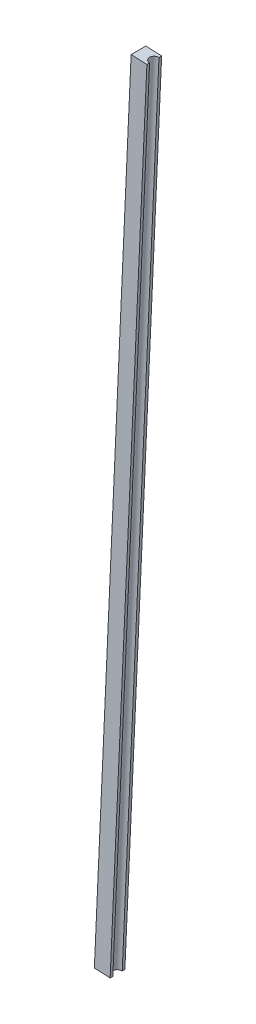
ISO-10303-21;
HEADER;
FILE_DESCRIPTION(('STEP AP214'),'2;1');
FILE_NAME('part.step','',(''),(''),'','','');
FILE_SCHEMA(('AUTOMOTIVE_DESIGN { 1 0 10303 214 1 1 1 1 }'));
ENDSEC;
DATA;
#1=APPLICATION_CONTEXT('core data for automotive mechanical design processes');
#2=APPLICATION_PROTOCOL_DEFINITION('international standard','automotive_design',2000,#1);
#3=PRODUCT_CONTEXT('',#1,'mechanical');
#4=PRODUCT('Part','Part','',(#3));
#5=PRODUCT_RELATED_PRODUCT_CATEGORY('part','',(#4));
#6=PRODUCT_DEFINITION_FORMATION('','',#4);
#7=PRODUCT_DEFINITION_CONTEXT('part definition',#1,'design');
#8=PRODUCT_DEFINITION('design','',#6,#7);
#9=PRODUCT_DEFINITION_SHAPE('','',#8);
#10=(LENGTH_UNIT() NAMED_UNIT(*) SI_UNIT(.MILLI.,.METRE.));
#11=(NAMED_UNIT(*) PLANE_ANGLE_UNIT() SI_UNIT($,.RADIAN.));
#12=(NAMED_UNIT(*) SI_UNIT($,.STERADIAN.) SOLID_ANGLE_UNIT());
#13=UNCERTAINTY_MEASURE_WITH_UNIT(LENGTH_MEASURE(1.E-05),#10,'distance_accuracy_value','');
#14=(GEOMETRIC_REPRESENTATION_CONTEXT(3) GLOBAL_UNCERTAINTY_ASSIGNED_CONTEXT((#13)) GLOBAL_UNIT_ASSIGNED_CONTEXT((#10,
#11,#12)) REPRESENTATION_CONTEXT('',''));
#15=CARTESIAN_POINT('',(0.,0.,0.));
#16=DIRECTION('',(0.,0.,1.));
#17=DIRECTION('',(1.,0.,0.));
#18=AXIS2_PLACEMENT_3D('',#15,#16,#17);
#19=CARTESIAN_POINT('',(34.0668819369406,-273.797180723568,5.74050841179486));
#20=DIRECTION('',(0.998970569790716,-0.0453629881292205,0.));
#21=DIRECTION('',(0.,0.,-1.));
#22=AXIS2_PLACEMENT_3D('',#19,#20,#21);
#23=PLANE('',#22);
#24=DIRECTION('',(0.,0.,-1.));
#25=VECTOR('',#24,1.);
#26=CARTESIAN_POINT('',(45.8195249014578,-14.9838855021282,3.12419999999949));
#27=LINE('',#26,#25);
#28=CARTESIAN_POINT('',(45.8195249014598,-14.9838855021284,4.59740000000182));
#29=VERTEX_POINT('',#28);
#30=CARTESIAN_POINT('',(45.8195249014578,-14.9838855021282,5.4356));
#31=VERTEX_POINT('',#30);
#32=EDGE_CURVE('E68',#29,#31,#27,.F.);
#33=ORIENTED_EDGE('',*,*,#32,.T.);
#34=DIRECTION('',(0.045362988129241,0.998970569790715,0.));
#35=VECTOR('',#34,1.);
#36=CARTESIAN_POINT('',(40.0584254090455,-141.853147865521,5.4356));
#37=LINE('',#36,#35);
#38=CARTESIAN_POINT('',(34.2973259166352,-268.72241022897,5.4356));
#39=VERTEX_POINT('',#38);
#40=EDGE_CURVE('E93',#31,#39,#37,.F.);
#41=ORIENTED_EDGE('',*,*,#40,.T.);
#42=DIRECTION('',(0.,0.,-1.));
#43=VECTOR('',#42,1.);
#44=CARTESIAN_POINT('',(34.2973259166391,-268.722410228985,5.0165));
#45=LINE('',#44,#43);
#46=CARTESIAN_POINT('',(34.2973259166391,-268.722410228985,4.59739999999818));
#47=VERTEX_POINT('',#46);
#48=EDGE_CURVE('E107',#47,#39,#45,.F.);
#49=ORIENTED_EDGE('',*,*,#48,.F.);
#50=DIRECTION('',(-0.0453629881292205,-0.998970569790716,0.));
#51=VECTOR('',#50,1.);
#52=CARTESIAN_POINT('',(40.0584254090494,-141.85314786558,4.5974));
#53=LINE('',#52,#51);
#54=EDGE_CURVE('E92',#47,#29,#53,.F.);
#55=ORIENTED_EDGE('',*,*,#54,.T.);
#56=EDGE_LOOP('',(#33,#41,#49,#55));
#57=FACE_BOUND('',#56,.T.);
#58=ADVANCED_FACE('F17',(#57),#23,.T.);
#59=CARTESIAN_POINT('',(34.0668819369406,-273.797180723568,1.95590841179588));
#60=DIRECTION('',(0.998970569790716,-0.0453629881292205,0.));
#61=DIRECTION('',(0.,0.,-1.));
#62=AXIS2_PLACEMENT_3D('',#59,#60,#61);
#63=PLANE('',#62);
#64=DIRECTION('',(0.,0.,-1.));
#65=VECTOR('',#64,1.);
#66=CARTESIAN_POINT('',(45.8195249014578,-14.9838855021282,3.12419999999949));
#67=LINE('',#66,#65);
#68=CARTESIAN_POINT('',(45.8195249014578,-14.9838855021282,0.8128));
#69=VERTEX_POINT('',#68);
#70=CARTESIAN_POINT('',(45.8195249014578,-14.9838855021283,1.65100000000545));
#71=VERTEX_POINT('',#70);
#72=EDGE_CURVE('E74',#69,#71,#67,.F.);
#73=ORIENTED_EDGE('',*,*,#72,.T.);
#74=DIRECTION('',(0.0453629881307493,0.998970569790647,0.));
#75=VECTOR('',#74,1.);
#76=CARTESIAN_POINT('',(40.0584254088512,-141.853147865571,1.651));
#77=LINE('',#76,#75);
#78=CARTESIAN_POINT('',(34.297325916443,-268.722410228976,1.65100000000182));
#79=VERTEX_POINT('',#78);
#80=EDGE_CURVE('E77',#71,#79,#77,.F.);
#81=ORIENTED_EDGE('',*,*,#80,.T.);
#82=DIRECTION('',(0.,0.,-1.));
#83=VECTOR('',#82,1.);
#84=CARTESIAN_POINT('',(34.2973259166391,-268.722410228985,1.2319));
#85=LINE('',#84,#83);
#86=CARTESIAN_POINT('',(34.2973259166294,-268.72241022894,0.8128));
#87=VERTEX_POINT('',#86);
#88=EDGE_CURVE('E82',#87,#79,#85,.F.);
#89=ORIENTED_EDGE('',*,*,#88,.F.);
#90=DIRECTION('',(-0.0453629881292411,-0.998970569790715,0.));
#91=VECTOR('',#90,1.);
#92=CARTESIAN_POINT('',(40.0584254090312,-141.85314786552,0.8128));
#93=LINE('',#92,#91);
#94=EDGE_CURVE('E80',#87,#69,#93,.F.);
#95=ORIENTED_EDGE('',*,*,#94,.T.);
#96=EDGE_LOOP('',(#73,#81,#89,#95));
#97=FACE_BOUND('',#96,.T.);
#98=ADVANCED_FACE('F76',(#97),#63,.T.);
#99=CARTESIAN_POINT('',(40.5670291394142,-14.7453710652593,0.507891588204124));
#100=DIRECTION('',(0.0453629881291912,0.998970569790718,0.));
#101=DIRECTION('',(0.,0.,1.));
#102=AXIS2_PLACEMENT_3D('',#99,#100,#101);
#103=PLANE('',#102);
#104=CARTESIAN_POINT('',(45.8195249016281,-14.983885502136,3.12420000000727));
#105=DIRECTION('',(0.0453629881299678,0.998970569790682,0.));
#106=DIRECTION('',(-0.998970569790682,0.0453629881299678,0.));
#107=AXIS2_PLACEMENT_3D('',#104,#105,#106);
#108=CIRCLE('',#107,1.47319999999637);
#109=EDGE_CURVE('E21',#29,#71,#108,.F.);
#110=ORIENTED_EDGE('',*,*,#109,.T.);
#111=ORIENTED_EDGE('',*,*,#72,.F.);
#112=DIRECTION('',(0.998970569790729,-0.0453629881289418,0.));
#113=VECTOR('',#112,1.);
#114=CARTESIAN_POINT('',(43.3455742853647,-14.8715440620268,0.8128));
#115=LINE('',#114,#113);
#116=CARTESIAN_POINT('',(40.87162366929,-14.7592026219252,0.8128));
#117=VERTEX_POINT('',#116);
#118=EDGE_CURVE('E118',#69,#117,#115,.F.);
#119=ORIENTED_EDGE('',*,*,#118,.T.);
#120=DIRECTION('',(0.,0.,-1.));
#121=VECTOR('',#120,1.);
#122=CARTESIAN_POINT('',(40.8716236692926,-14.7592026219245,3.12419999999949));
#123=LINE('',#122,#121);
#124=CARTESIAN_POINT('',(40.8716236692838,-14.7592026219242,5.4356));
#125=VERTEX_POINT('',#124);
#126=EDGE_CURVE('E137',#117,#125,#123,.F.);
#127=ORIENTED_EDGE('',*,*,#126,.T.);
#128=DIRECTION('',(-0.998970569790729,0.0453629881289419,0.));
#129=VECTOR('',#128,1.);
#130=CARTESIAN_POINT('',(43.3455742853648,-14.8715440620252,5.4356));
#131=LINE('',#130,#129);
#132=EDGE_CURVE('E97',#125,#31,#131,.F.);
#133=ORIENTED_EDGE('',*,*,#132,.T.);
#134=ORIENTED_EDGE('',*,*,#32,.F.);
#135=EDGE_LOOP('',(#110,#111,#119,#127,#133,#134));
#136=FACE_BOUND('',#135,.T.);
#137=ADVANCED_FACE('F91',(#136),#103,.T.);
#138=CARTESIAN_POINT('',(28.814386174897,-273.558666286704,5.4356));
#139=DIRECTION('',(0.,0.,1.));
#140=DIRECTION('',(0.998970569791785,-0.0453629881056857,0.));
#141=AXIS2_PLACEMENT_3D('',#138,#139,#140);
#142=PLANE('',#141);
#143=ORIENTED_EDGE('',*,*,#132,.F.);
#144=DIRECTION('',(0.0453629881293373,0.998970569790711,0.));
#145=VECTOR('',#144,1.);
#146=CARTESIAN_POINT('',(35.1105241768681,-141.628464985315,5.4356));
#147=LINE('',#146,#145);
#148=CARTESIAN_POINT('',(29.34942468444,-268.497727348806,5.4356));
#149=VERTEX_POINT('',#148);
#150=EDGE_CURVE('E132',#125,#149,#147,.F.);
#151=ORIENTED_EDGE('',*,*,#150,.T.);
#152=DIRECTION('',(0.998970569791783,-0.0453629881057157,0.));
#153=VECTOR('',#152,1.);
#154=CARTESIAN_POINT('',(31.823375300544,-268.610068788821,5.4356));
#155=LINE('',#154,#153);
#156=EDGE_CURVE('E129',#149,#39,#155,.T.);
#157=ORIENTED_EDGE('',*,*,#156,.T.);
#158=ORIENTED_EDGE('',*,*,#40,.F.);
#159=EDGE_LOOP('',(#143,#151,#157,#158));
#160=FACE_BOUND('',#159,.T.);
#161=ADVANCED_FACE('F147',(#160),#142,.T.);
#162=CARTESIAN_POINT('',(34.2973259166156,-268.722410228984,3.1242));
#163=DIRECTION('',(0.0453629881299678,0.998970569790682,0.));
#164=DIRECTION('',(-0.998970569790682,0.0453629881299678,0.));
#165=AXIS2_PLACEMENT_3D('',#162,#163,#164);
#166=CYLINDRICAL_SURFACE('',#165,1.47319999999637);
#167=ORIENTED_EDGE('',*,*,#109,.F.);
#168=ORIENTED_EDGE('',*,*,#54,.F.);
#169=CARTESIAN_POINT('',(34.2973259166156,-268.722410228984,3.1242));
#170=DIRECTION('',(0.0453629881299678,0.998970569790682,0.));
#171=DIRECTION('',(-0.998970569790682,0.0453629881299678,0.));
#172=AXIS2_PLACEMENT_3D('',#169,#170,#171);
#173=CIRCLE('',#172,1.47319999999637);
#174=EDGE_CURVE('E89',#47,#79,#173,.F.);
#175=ORIENTED_EDGE('',*,*,#174,.T.);
#176=ORIENTED_EDGE('',*,*,#80,.F.);
#177=EDGE_LOOP('',(#167,#168,#175,#176));
#178=FACE_BOUND('',#177,.T.);
#179=ADVANCED_FACE('F85',(#178),#166,.F.);
#180=CARTESIAN_POINT('',(34.3714764667902,-273.811012280106,0.8128));
#181=DIRECTION('',(0.,0.,-1.));
#182=DIRECTION('',(-0.998970569791785,0.0453629881056857,0.));
#183=AXIS2_PLACEMENT_3D('',#180,#181,#182);
#184=PLANE('',#183);
#185=ORIENTED_EDGE('',*,*,#118,.F.);
#186=ORIENTED_EDGE('',*,*,#94,.F.);
#187=DIRECTION('',(-0.998970569791783,0.0453629881057158,0.));
#188=VECTOR('',#187,1.);
#189=CARTESIAN_POINT('',(31.823375300544,-268.610068788821,0.8128));
#190=LINE('',#189,#188);
#191=CARTESIAN_POINT('',(29.3494246844578,-268.497727348688,0.8128));
#192=VERTEX_POINT('',#191);
#193=EDGE_CURVE('E27',#87,#192,#190,.T.);
#194=ORIENTED_EDGE('',*,*,#193,.T.);
#195=DIRECTION('',(-0.0453629881293373,-0.998970569790711,0.));
#196=VECTOR('',#195,1.);
#197=CARTESIAN_POINT('',(35.1105241768681,-141.628464985315,0.8128));
#198=LINE('',#197,#196);
#199=EDGE_CURVE('E35',#192,#117,#198,.F.);
#200=ORIENTED_EDGE('',*,*,#199,.T.);
#201=EDGE_LOOP('',(#185,#186,#194,#200));
#202=FACE_BOUND('',#201,.T.);
#203=ADVANCED_FACE('F143',(#202),#184,.T.);
#204=CARTESIAN_POINT('',(29.1189807047466,-273.572497843242,0.507891588204124));
#205=DIRECTION('',(-0.998970569790711,0.0453629881293373,0.));
#206=DIRECTION('',(0.,0.,1.));
#207=AXIS2_PLACEMENT_3D('',#204,#205,#206);
#208=PLANE('',#207);
#209=ORIENTED_EDGE('',*,*,#126,.F.);
#210=ORIENTED_EDGE('',*,*,#199,.F.);
#211=DIRECTION('',(0.,0.,1.));
#212=VECTOR('',#211,1.);
#213=CARTESIAN_POINT('',(29.3494246844416,-268.497727348777,3.12419999999949));
#214=LINE('',#213,#212);
#215=EDGE_CURVE('E11',#192,#149,#214,.T.);
#216=ORIENTED_EDGE('',*,*,#215,.T.);
#217=ORIENTED_EDGE('',*,*,#150,.F.);
#218=EDGE_LOOP('',(#209,#210,#216,#217));
#219=FACE_BOUND('',#218,.T.);
#220=ADVANCED_FACE('F146',(#219),#208,.T.);
#221=CARTESIAN_POINT('',(29.0448301545974,-268.48389579212,0.507891588204124));
#222=DIRECTION('',(0.0453629881057157,0.998970569791784,0.));
#223=DIRECTION('',(0.,0.,1.));
#224=AXIS2_PLACEMENT_3D('',#221,#222,#223);
#225=PLANE('',#224);
#226=ORIENTED_EDGE('',*,*,#193,.F.);
#227=ORIENTED_EDGE('',*,*,#88,.T.);
#228=ORIENTED_EDGE('',*,*,#174,.F.);
#229=ORIENTED_EDGE('',*,*,#48,.T.);
#230=ORIENTED_EDGE('',*,*,#156,.F.);
#231=ORIENTED_EDGE('',*,*,#215,.F.);
#232=EDGE_LOOP('',(#226,#227,#228,#229,#230,#231));
#233=FACE_BOUND('',#232,.T.);
#234=ADVANCED_FACE('F19',(#233),#225,.F.);
#235=CLOSED_SHELL('',(#58,#98,#137,#161,#179,#203,#220,#234));
#236=MANIFOLD_SOLID_BREP('B1',#235);
#237=ADVANCED_BREP_SHAPE_REPRESENTATION('',(#18,#236),#14);
#238=SHAPE_DEFINITION_REPRESENTATION(#9,#237);
ENDSEC;
END-ISO-10303-21;
